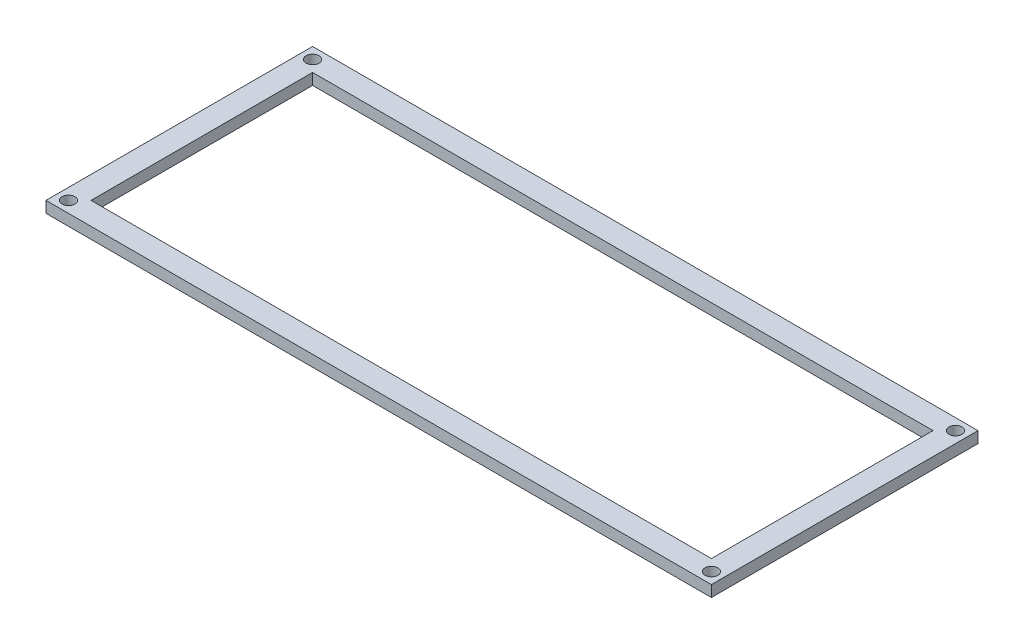
ISO-10303-21;
HEADER;
FILE_DESCRIPTION(('STEP AP214'),'2;1');
FILE_NAME('part.step','',(''),(''),'','','');
FILE_SCHEMA(('AUTOMOTIVE_DESIGN { 1 0 10303 214 1 1 1 1 }'));
ENDSEC;
DATA;
#1=APPLICATION_CONTEXT('core data for automotive mechanical design processes');
#2=APPLICATION_PROTOCOL_DEFINITION('international standard','automotive_design',2000,#1);
#3=PRODUCT_CONTEXT('',#1,'mechanical');
#4=PRODUCT('Part','Part','',(#3));
#5=PRODUCT_RELATED_PRODUCT_CATEGORY('part','',(#4));
#6=PRODUCT_DEFINITION_FORMATION('','',#4);
#7=PRODUCT_DEFINITION_CONTEXT('part definition',#1,'design');
#8=PRODUCT_DEFINITION('design','',#6,#7);
#9=PRODUCT_DEFINITION_SHAPE('','',#8);
#10=(LENGTH_UNIT() NAMED_UNIT(*) SI_UNIT(.MILLI.,.METRE.));
#11=(NAMED_UNIT(*) PLANE_ANGLE_UNIT() SI_UNIT($,.RADIAN.));
#12=(NAMED_UNIT(*) SI_UNIT($,.STERADIAN.) SOLID_ANGLE_UNIT());
#13=UNCERTAINTY_MEASURE_WITH_UNIT(LENGTH_MEASURE(1.E-05),#10,'distance_accuracy_value','');
#14=(GEOMETRIC_REPRESENTATION_CONTEXT(3) GLOBAL_UNCERTAINTY_ASSIGNED_CONTEXT((#13)) GLOBAL_UNIT_ASSIGNED_CONTEXT((#10,
#11,#12)) REPRESENTATION_CONTEXT('',''));
#15=CARTESIAN_POINT('',(0.,0.,0.));
#16=DIRECTION('',(0.,0.,1.));
#17=DIRECTION('',(1.,0.,0.));
#18=AXIS2_PLACEMENT_3D('',#15,#16,#17);
#19=CARTESIAN_POINT('',(0.,2.54,0.));
#20=DIRECTION('',(0.,-1.,0.));
#21=DIRECTION('',(0.,0.,-1.));
#22=AXIS2_PLACEMENT_3D('',#19,#20,#21);
#23=PLANE('',#22);
#24=CARTESIAN_POINT('',(-72.539999954,2.54,27.540000038));
#25=DIRECTION('',(0.,1.,0.));
#26=DIRECTION('',(0.,0.,-1.));
#27=AXIS2_PLACEMENT_3D('',#24,#25,#26);
#28=CIRCLE('',#27,1.4605);
#29=CARTESIAN_POINT('',(-72.539999954,2.54,26.079500038));
#30=VERTEX_POINT('',#29);
#31=EDGE_CURVE('E289',#30,#30,#28,.T.);
#32=ORIENTED_EDGE('',*,*,#31,.F.);
#33=EDGE_LOOP('',(#32));
#34=FACE_BOUND('',#33,.T.);
#35=CARTESIAN_POINT('',(-72.539999954,2.54,-27.540000038));
#36=DIRECTION('',(0.,1.,0.));
#37=DIRECTION('',(0.,0.,1.));
#38=AXIS2_PLACEMENT_3D('',#35,#36,#37);
#39=CIRCLE('',#38,1.4605);
#40=CARTESIAN_POINT('',(-72.539999954,2.54,-26.079500038));
#41=VERTEX_POINT('',#40);
#42=EDGE_CURVE('E279',#41,#41,#39,.T.);
#43=ORIENTED_EDGE('',*,*,#42,.F.);
#44=EDGE_LOOP('',(#43));
#45=FACE_BOUND('',#44,.T.);
#46=CARTESIAN_POINT('',(72.539999954,2.54,-27.540000038));
#47=DIRECTION('',(0.,1.,0.));
#48=DIRECTION('',(0.,0.,-1.));
#49=AXIS2_PLACEMENT_3D('',#46,#47,#48);
#50=CIRCLE('',#49,1.4605);
#51=CARTESIAN_POINT('',(72.539999954,2.54,-29.000500038));
#52=VERTEX_POINT('',#51);
#53=EDGE_CURVE('E269',#52,#52,#50,.T.);
#54=ORIENTED_EDGE('',*,*,#53,.F.);
#55=EDGE_LOOP('',(#54));
#56=FACE_BOUND('',#55,.T.);
#57=CARTESIAN_POINT('',(72.539999954,2.54,27.540000038));
#58=DIRECTION('',(0.,1.,0.));
#59=DIRECTION('',(0.,0.,1.));
#60=AXIS2_PLACEMENT_3D('',#57,#58,#59);
#61=CIRCLE('',#60,1.4605);
#62=CARTESIAN_POINT('',(72.539999954,2.54,29.000500038));
#63=VERTEX_POINT('',#62);
#64=EDGE_CURVE('E276',#63,#63,#61,.T.);
#65=ORIENTED_EDGE('',*,*,#64,.F.);
#66=EDGE_LOOP('',(#65));
#67=FACE_BOUND('',#66,.T.);
#68=DIRECTION('',(0.,0.,1.));
#69=VECTOR('',#68,1.);
#70=CARTESIAN_POINT('',(-75.079999954,2.54,30.080000038));
#71=LINE('',#70,#69);
#72=CARTESIAN_POINT('',(-75.079999954,2.54,-30.080000038));
#73=VERTEX_POINT('',#72);
#74=CARTESIAN_POINT('',(-75.079999954,2.54,30.080000038));
#75=VERTEX_POINT('',#74);
#76=EDGE_CURVE('E155',#73,#75,#71,.T.);
#77=ORIENTED_EDGE('',*,*,#76,.T.);
#78=DIRECTION('',(1.,0.,0.));
#79=VECTOR('',#78,1.);
#80=CARTESIAN_POINT('',(-75.079999954,2.54,30.080000038));
#81=LINE('',#80,#79);
#82=CARTESIAN_POINT('',(75.079999954,2.54,30.080000038));
#83=VERTEX_POINT('',#82);
#84=EDGE_CURVE('E159',#75,#83,#81,.T.);
#85=ORIENTED_EDGE('',*,*,#84,.T.);
#86=DIRECTION('',(0.,0.,-1.));
#87=VECTOR('',#86,1.);
#88=CARTESIAN_POINT('',(75.079999954,2.54,30.080000038));
#89=LINE('',#88,#87);
#90=CARTESIAN_POINT('',(75.079999954,2.54,-30.080000038));
#91=VERTEX_POINT('',#90);
#92=EDGE_CURVE('E163',#83,#91,#89,.T.);
#93=ORIENTED_EDGE('',*,*,#92,.T.);
#94=DIRECTION('',(-1.,0.,0.));
#95=VECTOR('',#94,1.);
#96=CARTESIAN_POINT('',(-75.079999954,2.54,-30.080000038));
#97=LINE('',#96,#95);
#98=EDGE_CURVE('E166',#91,#73,#97,.T.);
#99=ORIENTED_EDGE('',*,*,#98,.T.);
#100=EDGE_LOOP('',(#77,#85,#93,#99));
#101=FACE_BOUND('',#100,.T.);
#102=DIRECTION('',(0.,0.,-1.));
#103=VECTOR('',#102,1.);
#104=CARTESIAN_POINT('',(69.999999954,2.54,25.000000038));
#105=LINE('',#104,#103);
#106=CARTESIAN_POINT('',(69.999999954,2.54,25.000000038));
#107=VERTEX_POINT('',#106);
#108=CARTESIAN_POINT('',(69.999999954,2.54,-25.000000038));
#109=VERTEX_POINT('',#108);
#110=EDGE_CURVE('E105',#107,#109,#105,.T.);
#111=ORIENTED_EDGE('',*,*,#110,.F.);
#112=DIRECTION('',(1.,0.,0.));
#113=VECTOR('',#112,1.);
#114=CARTESIAN_POINT('',(-69.999999954,2.54,25.000000038));
#115=LINE('',#114,#113);
#116=CARTESIAN_POINT('',(-69.999999954,2.54,25.000000038));
#117=VERTEX_POINT('',#116);
#118=EDGE_CURVE('E131',#117,#107,#115,.T.);
#119=ORIENTED_EDGE('',*,*,#118,.F.);
#120=DIRECTION('',(0.,0.,1.));
#121=VECTOR('',#120,1.);
#122=CARTESIAN_POINT('',(-69.999999954,2.54,25.000000038));
#123=LINE('',#122,#121);
#124=CARTESIAN_POINT('',(-69.999999954,2.54,-25.000000038));
#125=VERTEX_POINT('',#124);
#126=EDGE_CURVE('E127',#125,#117,#123,.T.);
#127=ORIENTED_EDGE('',*,*,#126,.F.);
#128=DIRECTION('',(-1.,0.,0.));
#129=VECTOR('',#128,1.);
#130=CARTESIAN_POINT('',(-69.999999954,2.54,-25.000000038));
#131=LINE('',#130,#129);
#132=EDGE_CURVE('E114',#109,#125,#131,.T.);
#133=ORIENTED_EDGE('',*,*,#132,.F.);
#134=EDGE_LOOP('',(#111,#119,#127,#133));
#135=FACE_BOUND('',#134,.T.);
#136=ADVANCED_FACE('F39',(#34,#45,#56,#67,#101,#135),#23,.F.);
#137=CARTESIAN_POINT('',(0.,0.,0.));
#138=DIRECTION('',(0.,-1.,0.));
#139=DIRECTION('',(0.,0.,-1.));
#140=AXIS2_PLACEMENT_3D('',#137,#138,#139);
#141=PLANE('',#140);
#142=CARTESIAN_POINT('',(-72.539999954,0.,27.540000038));
#143=DIRECTION('',(0.,1.,0.));
#144=DIRECTION('',(0.,0.,-1.));
#145=AXIS2_PLACEMENT_3D('',#142,#143,#144);
#146=CIRCLE('',#145,1.4605);
#147=CARTESIAN_POINT('',(-72.539999954,0.,26.079500038));
#148=VERTEX_POINT('',#147);
#149=EDGE_CURVE('E285',#148,#148,#146,.T.);
#150=ORIENTED_EDGE('',*,*,#149,.T.);
#151=EDGE_LOOP('',(#150));
#152=FACE_BOUND('',#151,.T.);
#153=CARTESIAN_POINT('',(-72.539999954,0.,-27.540000038));
#154=DIRECTION('',(0.,1.,0.));
#155=DIRECTION('',(0.,0.,1.));
#156=AXIS2_PLACEMENT_3D('',#153,#154,#155);
#157=CIRCLE('',#156,1.4605);
#158=CARTESIAN_POINT('',(-72.539999954,0.,-26.079500038));
#159=VERTEX_POINT('',#158);
#160=EDGE_CURVE('E272',#159,#159,#157,.T.);
#161=ORIENTED_EDGE('',*,*,#160,.T.);
#162=EDGE_LOOP('',(#161));
#163=FACE_BOUND('',#162,.T.);
#164=CARTESIAN_POINT('',(72.539999954,0.,-27.540000038));
#165=DIRECTION('',(0.,1.,0.));
#166=DIRECTION('',(0.,0.,-1.));
#167=AXIS2_PLACEMENT_3D('',#164,#165,#166);
#168=CIRCLE('',#167,1.4605);
#169=CARTESIAN_POINT('',(72.539999954,0.,-29.000500038));
#170=VERTEX_POINT('',#169);
#171=EDGE_CURVE('E266',#170,#170,#168,.T.);
#172=ORIENTED_EDGE('',*,*,#171,.T.);
#173=EDGE_LOOP('',(#172));
#174=FACE_BOUND('',#173,.T.);
#175=CARTESIAN_POINT('',(72.539999954,0.,27.540000038));
#176=DIRECTION('',(0.,1.,0.));
#177=DIRECTION('',(0.,0.,1.));
#178=AXIS2_PLACEMENT_3D('',#175,#176,#177);
#179=CIRCLE('',#178,1.4605);
#180=CARTESIAN_POINT('',(72.539999954,0.,29.000500038));
#181=VERTEX_POINT('',#180);
#182=EDGE_CURVE('E139',#181,#181,#179,.T.);
#183=ORIENTED_EDGE('',*,*,#182,.T.);
#184=EDGE_LOOP('',(#183));
#185=FACE_BOUND('',#184,.T.);
#186=DIRECTION('',(0.,0.,1.));
#187=VECTOR('',#186,1.);
#188=CARTESIAN_POINT('',(-75.079999954,0.,30.080000038));
#189=LINE('',#188,#187);
#190=CARTESIAN_POINT('',(-75.079999954,0.,-30.080000038));
#191=VERTEX_POINT('',#190);
#192=CARTESIAN_POINT('',(-75.079999954,0.,30.080000038));
#193=VERTEX_POINT('',#192);
#194=EDGE_CURVE('E123',#191,#193,#189,.T.);
#195=ORIENTED_EDGE('',*,*,#194,.F.);
#196=DIRECTION('',(-1.,0.,0.));
#197=VECTOR('',#196,1.);
#198=CARTESIAN_POINT('',(-75.079999954,0.,-30.080000038));
#199=LINE('',#198,#197);
#200=CARTESIAN_POINT('',(75.079999954,0.,-30.080000038));
#201=VERTEX_POINT('',#200);
#202=EDGE_CURVE('E160',#201,#191,#199,.T.);
#203=ORIENTED_EDGE('',*,*,#202,.F.);
#204=DIRECTION('',(0.,0.,-1.));
#205=VECTOR('',#204,1.);
#206=CARTESIAN_POINT('',(75.079999954,0.,30.080000038));
#207=LINE('',#206,#205);
#208=CARTESIAN_POINT('',(75.079999954,0.,30.080000038));
#209=VERTEX_POINT('',#208);
#210=EDGE_CURVE('E176',#209,#201,#207,.T.);
#211=ORIENTED_EDGE('',*,*,#210,.F.);
#212=DIRECTION('',(1.,0.,0.));
#213=VECTOR('',#212,1.);
#214=CARTESIAN_POINT('',(-75.079999954,0.,30.080000038));
#215=LINE('',#214,#213);
#216=EDGE_CURVE('E173',#193,#209,#215,.T.);
#217=ORIENTED_EDGE('',*,*,#216,.F.);
#218=EDGE_LOOP('',(#195,#203,#211,#217));
#219=FACE_BOUND('',#218,.T.);
#220=DIRECTION('',(1.,0.,0.));
#221=VECTOR('',#220,1.);
#222=CARTESIAN_POINT('',(-69.999999954,0.,25.000000038));
#223=LINE('',#222,#221);
#224=CARTESIAN_POINT('',(-69.999999954,0.,25.000000038));
#225=VERTEX_POINT('',#224);
#226=CARTESIAN_POINT('',(69.999999954,0.,25.000000038));
#227=VERTEX_POINT('',#226);
#228=EDGE_CURVE('E115',#225,#227,#223,.T.);
#229=ORIENTED_EDGE('',*,*,#228,.T.);
#230=DIRECTION('',(0.,0.,-1.));
#231=VECTOR('',#230,1.);
#232=CARTESIAN_POINT('',(69.999999954,0.,25.000000038));
#233=LINE('',#232,#231);
#234=CARTESIAN_POINT('',(69.999999954,0.,-25.000000038));
#235=VERTEX_POINT('',#234);
#236=EDGE_CURVE('E63',#227,#235,#233,.T.);
#237=ORIENTED_EDGE('',*,*,#236,.T.);
#238=DIRECTION('',(-1.,0.,0.));
#239=VECTOR('',#238,1.);
#240=CARTESIAN_POINT('',(-69.999999954,0.,-25.000000038));
#241=LINE('',#240,#239);
#242=CARTESIAN_POINT('',(-69.999999954,0.,-25.000000038));
#243=VERTEX_POINT('',#242);
#244=EDGE_CURVE('E121',#235,#243,#241,.T.);
#245=ORIENTED_EDGE('',*,*,#244,.T.);
#246=DIRECTION('',(0.,0.,1.));
#247=VECTOR('',#246,1.);
#248=CARTESIAN_POINT('',(-69.999999954,0.,25.000000038));
#249=LINE('',#248,#247);
#250=EDGE_CURVE('E142',#243,#225,#249,.T.);
#251=ORIENTED_EDGE('',*,*,#250,.T.);
#252=EDGE_LOOP('',(#229,#237,#245,#251));
#253=FACE_BOUND('',#252,.T.);
#254=ADVANCED_FACE('F199',(#152,#163,#174,#185,#219,#253),#141,.T.);
#255=CARTESIAN_POINT('',(-75.079999954,2.54,30.080000038));
#256=DIRECTION('',(1.,0.,0.));
#257=DIRECTION('',(0.,0.,-1.));
#258=AXIS2_PLACEMENT_3D('',#255,#256,#257);
#259=PLANE('',#258);
#260=ORIENTED_EDGE('',*,*,#194,.T.);
#261=DIRECTION('',(0.,-1.,0.));
#262=VECTOR('',#261,1.);
#263=CARTESIAN_POINT('',(-75.079999954,2.54,30.080000038));
#264=LINE('',#263,#262);
#265=EDGE_CURVE('E11',#75,#193,#264,.T.);
#266=ORIENTED_EDGE('',*,*,#265,.F.);
#267=ORIENTED_EDGE('',*,*,#76,.F.);
#268=DIRECTION('',(0.,-1.,0.));
#269=VECTOR('',#268,1.);
#270=CARTESIAN_POINT('',(-75.079999954,2.54,-30.080000038));
#271=LINE('',#270,#269);
#272=EDGE_CURVE('E169',#73,#191,#271,.T.);
#273=ORIENTED_EDGE('',*,*,#272,.T.);
#274=EDGE_LOOP('',(#260,#266,#267,#273));
#275=FACE_BOUND('',#274,.T.);
#276=ADVANCED_FACE('F41',(#275),#259,.F.);
#277=CARTESIAN_POINT('',(-75.079999954,2.54,30.080000038));
#278=DIRECTION('',(0.,0.,-1.));
#279=DIRECTION('',(-1.,0.,0.));
#280=AXIS2_PLACEMENT_3D('',#277,#278,#279);
#281=PLANE('',#280);
#282=ORIENTED_EDGE('',*,*,#216,.T.);
#283=DIRECTION('',(0.,-1.,0.));
#284=VECTOR('',#283,1.);
#285=CARTESIAN_POINT('',(75.079999954,2.54,30.080000038));
#286=LINE('',#285,#284);
#287=EDGE_CURVE('E48',#83,#209,#286,.T.);
#288=ORIENTED_EDGE('',*,*,#287,.F.);
#289=ORIENTED_EDGE('',*,*,#84,.F.);
#290=ORIENTED_EDGE('',*,*,#265,.T.);
#291=EDGE_LOOP('',(#282,#288,#289,#290));
#292=FACE_BOUND('',#291,.T.);
#293=ADVANCED_FACE('F209',(#292),#281,.F.);
#294=CARTESIAN_POINT('',(75.079999954,2.54,30.080000038));
#295=DIRECTION('',(-1.,0.,0.));
#296=DIRECTION('',(0.,0.,1.));
#297=AXIS2_PLACEMENT_3D('',#294,#295,#296);
#298=PLANE('',#297);
#299=ORIENTED_EDGE('',*,*,#210,.T.);
#300=DIRECTION('',(0.,-1.,0.));
#301=VECTOR('',#300,1.);
#302=CARTESIAN_POINT('',(75.079999954,2.54,-30.080000038));
#303=LINE('',#302,#301);
#304=EDGE_CURVE('E184',#91,#201,#303,.T.);
#305=ORIENTED_EDGE('',*,*,#304,.F.);
#306=ORIENTED_EDGE('',*,*,#92,.F.);
#307=ORIENTED_EDGE('',*,*,#287,.T.);
#308=EDGE_LOOP('',(#299,#305,#306,#307));
#309=FACE_BOUND('',#308,.T.);
#310=ADVANCED_FACE('F193',(#309),#298,.F.);
#311=CARTESIAN_POINT('',(-75.079999954,2.54,-30.080000038));
#312=DIRECTION('',(0.,0.,1.));
#313=DIRECTION('',(1.,0.,0.));
#314=AXIS2_PLACEMENT_3D('',#311,#312,#313);
#315=PLANE('',#314);
#316=ORIENTED_EDGE('',*,*,#202,.T.);
#317=ORIENTED_EDGE('',*,*,#272,.F.);
#318=ORIENTED_EDGE('',*,*,#98,.F.);
#319=ORIENTED_EDGE('',*,*,#304,.T.);
#320=EDGE_LOOP('',(#316,#317,#318,#319));
#321=FACE_BOUND('',#320,.T.);
#322=ADVANCED_FACE('F203',(#321),#315,.F.);
#323=CARTESIAN_POINT('',(69.999999954,2.54,25.000000038));
#324=DIRECTION('',(-1.,0.,0.));
#325=DIRECTION('',(0.,0.,1.));
#326=AXIS2_PLACEMENT_3D('',#323,#324,#325);
#327=PLANE('',#326);
#328=ORIENTED_EDGE('',*,*,#236,.F.);
#329=DIRECTION('',(0.,-1.,0.));
#330=VECTOR('',#329,1.);
#331=CARTESIAN_POINT('',(69.999999954,2.54,25.000000038));
#332=LINE('',#331,#330);
#333=EDGE_CURVE('E109',#107,#227,#332,.T.);
#334=ORIENTED_EDGE('',*,*,#333,.F.);
#335=ORIENTED_EDGE('',*,*,#110,.T.);
#336=DIRECTION('',(0.,-1.,0.));
#337=VECTOR('',#336,1.);
#338=CARTESIAN_POINT('',(69.999999954,2.54,-25.000000038));
#339=LINE('',#338,#337);
#340=EDGE_CURVE('E108',#109,#235,#339,.T.);
#341=ORIENTED_EDGE('',*,*,#340,.T.);
#342=EDGE_LOOP('',(#328,#334,#335,#341));
#343=FACE_BOUND('',#342,.T.);
#344=ADVANCED_FACE('F107',(#343),#327,.T.);
#345=CARTESIAN_POINT('',(-69.999999954,2.54,-25.000000038));
#346=DIRECTION('',(0.,0.,1.));
#347=DIRECTION('',(1.,0.,0.));
#348=AXIS2_PLACEMENT_3D('',#345,#346,#347);
#349=PLANE('',#348);
#350=ORIENTED_EDGE('',*,*,#244,.F.);
#351=ORIENTED_EDGE('',*,*,#340,.F.);
#352=ORIENTED_EDGE('',*,*,#132,.T.);
#353=DIRECTION('',(0.,-1.,0.));
#354=VECTOR('',#353,1.);
#355=CARTESIAN_POINT('',(-69.999999954,2.54,-25.000000038));
#356=LINE('',#355,#354);
#357=EDGE_CURVE('E124',#125,#243,#356,.T.);
#358=ORIENTED_EDGE('',*,*,#357,.T.);
#359=EDGE_LOOP('',(#350,#351,#352,#358));
#360=FACE_BOUND('',#359,.T.);
#361=ADVANCED_FACE('F118',(#360),#349,.T.);
#362=CARTESIAN_POINT('',(-69.999999954,2.54,25.000000038));
#363=DIRECTION('',(1.,0.,0.));
#364=DIRECTION('',(0.,0.,-1.));
#365=AXIS2_PLACEMENT_3D('',#362,#363,#364);
#366=PLANE('',#365);
#367=ORIENTED_EDGE('',*,*,#250,.F.);
#368=ORIENTED_EDGE('',*,*,#357,.F.);
#369=ORIENTED_EDGE('',*,*,#126,.T.);
#370=DIRECTION('',(0.,-1.,0.));
#371=VECTOR('',#370,1.);
#372=CARTESIAN_POINT('',(-69.999999954,2.54,25.000000038));
#373=LINE('',#372,#371);
#374=EDGE_CURVE('E55',#117,#225,#373,.T.);
#375=ORIENTED_EDGE('',*,*,#374,.T.);
#376=EDGE_LOOP('',(#367,#368,#369,#375));
#377=FACE_BOUND('',#376,.T.);
#378=ADVANCED_FACE('F236',(#377),#366,.T.);
#379=CARTESIAN_POINT('',(-69.999999954,2.54,25.000000038));
#380=DIRECTION('',(0.,0.,-1.));
#381=DIRECTION('',(-1.,0.,0.));
#382=AXIS2_PLACEMENT_3D('',#379,#380,#381);
#383=PLANE('',#382);
#384=ORIENTED_EDGE('',*,*,#228,.F.);
#385=ORIENTED_EDGE('',*,*,#374,.F.);
#386=ORIENTED_EDGE('',*,*,#118,.T.);
#387=ORIENTED_EDGE('',*,*,#333,.T.);
#388=EDGE_LOOP('',(#384,#385,#386,#387));
#389=FACE_BOUND('',#388,.T.);
#390=ADVANCED_FACE('F240',(#389),#383,.T.);
#391=CARTESIAN_POINT('',(72.539999954,0.,27.540000038));
#392=DIRECTION('',(0.,1.,0.));
#393=DIRECTION('',(0.,0.,1.));
#394=AXIS2_PLACEMENT_3D('',#391,#392,#393);
#395=CYLINDRICAL_SURFACE('',#394,1.4605);
#396=ORIENTED_EDGE('',*,*,#182,.F.);
#397=EDGE_LOOP('',(#396));
#398=FACE_BOUND('',#397,.T.);
#399=ORIENTED_EDGE('',*,*,#64,.T.);
#400=EDGE_LOOP('',(#399));
#401=FACE_BOUND('',#400,.T.);
#402=ADVANCED_FACE('F246',(#398,#401),#395,.F.);
#403=CARTESIAN_POINT('',(72.539999954,0.,-27.540000038));
#404=DIRECTION('',(0.,1.,0.));
#405=DIRECTION('',(0.,0.,1.));
#406=AXIS2_PLACEMENT_3D('',#403,#404,#405);
#407=CYLINDRICAL_SURFACE('',#406,1.4605);
#408=ORIENTED_EDGE('',*,*,#171,.F.);
#409=EDGE_LOOP('',(#408));
#410=FACE_BOUND('',#409,.T.);
#411=ORIENTED_EDGE('',*,*,#53,.T.);
#412=EDGE_LOOP('',(#411));
#413=FACE_BOUND('',#412,.T.);
#414=ADVANCED_FACE('F249',(#410,#413),#407,.F.);
#415=CARTESIAN_POINT('',(-72.539999954,0.,-27.540000038));
#416=DIRECTION('',(0.,1.,0.));
#417=DIRECTION('',(0.,0.,1.));
#418=AXIS2_PLACEMENT_3D('',#415,#416,#417);
#419=CYLINDRICAL_SURFACE('',#418,1.4605);
#420=ORIENTED_EDGE('',*,*,#160,.F.);
#421=EDGE_LOOP('',(#420));
#422=FACE_BOUND('',#421,.T.);
#423=ORIENTED_EDGE('',*,*,#42,.T.);
#424=EDGE_LOOP('',(#423));
#425=FACE_BOUND('',#424,.T.);
#426=ADVANCED_FACE('F254',(#422,#425),#419,.F.);
#427=CARTESIAN_POINT('',(-72.539999954,0.,27.540000038));
#428=DIRECTION('',(0.,1.,0.));
#429=DIRECTION('',(0.,0.,1.));
#430=AXIS2_PLACEMENT_3D('',#427,#428,#429);
#431=CYLINDRICAL_SURFACE('',#430,1.4605);
#432=ORIENTED_EDGE('',*,*,#149,.F.);
#433=EDGE_LOOP('',(#432));
#434=FACE_BOUND('',#433,.T.);
#435=ORIENTED_EDGE('',*,*,#31,.T.);
#436=EDGE_LOOP('',(#435));
#437=FACE_BOUND('',#436,.T.);
#438=ADVANCED_FACE('F251',(#434,#437),#431,.F.);
#439=CLOSED_SHELL('',(#136,#254,#276,#293,#310,#322,#344,#361,#378,#390,#402,#414,#426,#438));
#440=MANIFOLD_SOLID_BREP('B2',#439);
#441=ADVANCED_BREP_SHAPE_REPRESENTATION('',(#18,#440),#14);
#442=SHAPE_DEFINITION_REPRESENTATION(#9,#441);
ENDSEC;
END-ISO-10303-21;
